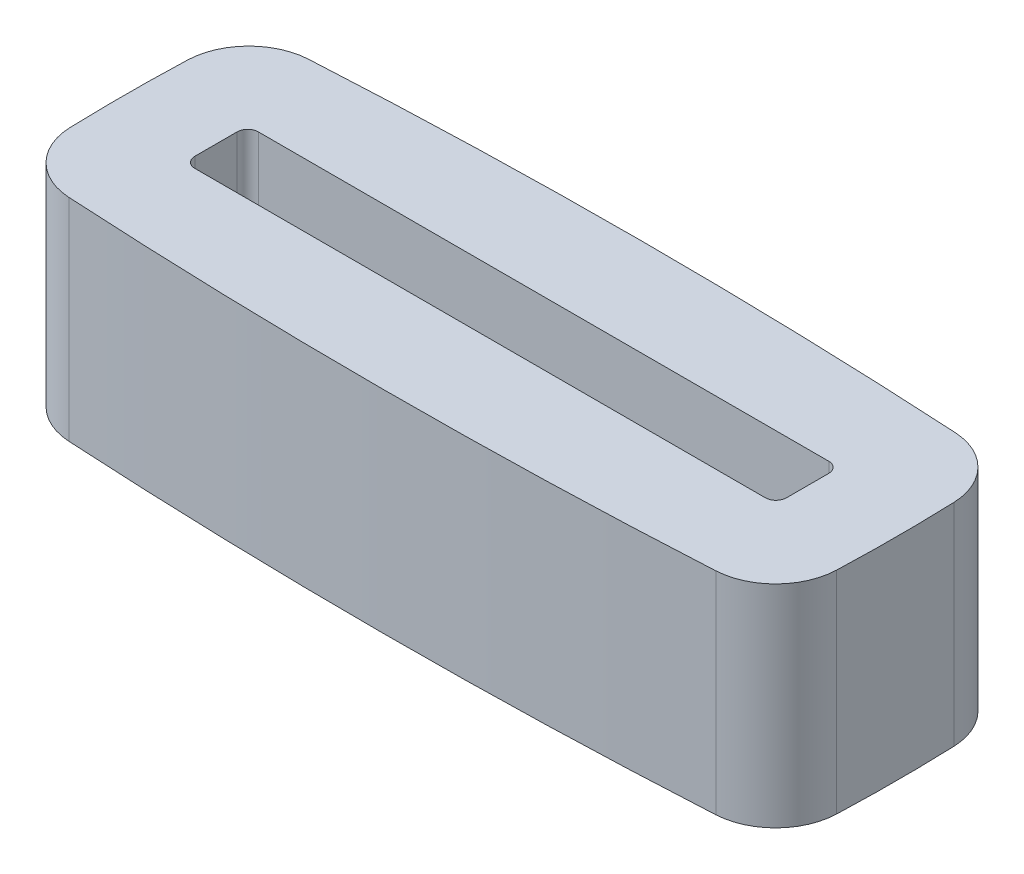
ISO-10303-21;
HEADER;
FILE_DESCRIPTION(('STEP AP214'),'2;1');
FILE_NAME('part.step','',(''),(''),'','','');
FILE_SCHEMA(('AUTOMOTIVE_DESIGN { 1 0 10303 214 1 1 1 1 }'));
ENDSEC;
DATA;
#1=APPLICATION_CONTEXT('core data for automotive mechanical design processes');
#2=APPLICATION_PROTOCOL_DEFINITION('international standard','automotive_design',2000,#1);
#3=PRODUCT_CONTEXT('',#1,'mechanical');
#4=PRODUCT('Part','Part','',(#3));
#5=PRODUCT_RELATED_PRODUCT_CATEGORY('part','',(#4));
#6=PRODUCT_DEFINITION_FORMATION('','',#4);
#7=PRODUCT_DEFINITION_CONTEXT('part definition',#1,'design');
#8=PRODUCT_DEFINITION('design','',#6,#7);
#9=PRODUCT_DEFINITION_SHAPE('','',#8);
#10=(LENGTH_UNIT() NAMED_UNIT(*) SI_UNIT(.MILLI.,.METRE.));
#11=(NAMED_UNIT(*) PLANE_ANGLE_UNIT() SI_UNIT($,.RADIAN.));
#12=(NAMED_UNIT(*) SI_UNIT($,.STERADIAN.) SOLID_ANGLE_UNIT());
#13=UNCERTAINTY_MEASURE_WITH_UNIT(LENGTH_MEASURE(1.E-05),#10,'distance_accuracy_value','');
#14=(GEOMETRIC_REPRESENTATION_CONTEXT(3) GLOBAL_UNCERTAINTY_ASSIGNED_CONTEXT((#13)) GLOBAL_UNIT_ASSIGNED_CONTEXT((#10,
#11,#12)) REPRESENTATION_CONTEXT('',''));
#15=CARTESIAN_POINT('',(0.,0.,0.));
#16=DIRECTION('',(0.,0.,1.));
#17=DIRECTION('',(1.,0.,0.));
#18=AXIS2_PLACEMENT_3D('',#15,#16,#17);
#19=CARTESIAN_POINT('',(23.7685199199291,10.,131.074830109099));
#20=DIRECTION('',(0.,-1.,0.));
#21=DIRECTION('',(0.,0.,-1.));
#22=AXIS2_PLACEMENT_3D('',#19,#20,#21);
#23=PLANE('',#22);
#24=CARTESIAN_POINT('',(55.493496787136,10.,-0.700070294959144));
#25=DIRECTION('',(0.,1.,0.));
#26=DIRECTION('',(0.,0.,-1.));
#27=AXIS2_PLACEMENT_3D('',#24,#25,#26);
#28=CIRCLE('',#27,81.635723644874);
#29=CARTESIAN_POINT('',(-26.0872461160428,10.,-3.69569416782523));
#30=VERTEX_POINT('',#29);
#31=CARTESIAN_POINT('',(-26.102389019081,10.,1.84998745360925));
#32=VERTEX_POINT('',#31);
#33=EDGE_CURVE('E185',#30,#32,#28,.T.);
#34=ORIENTED_EDGE('',*,*,#33,.T.);
#35=CARTESIAN_POINT('',(-23.1038530045843,10.,1.75627635625946));
#36=DIRECTION('',(0.,-1.,0.));
#37=DIRECTION('',(0.,0.,-1.));
#38=AXIS2_PLACEMENT_3D('',#35,#36,#37);
#39=CIRCLE('',#38,3.);
#40=CARTESIAN_POINT('',(-23.2736945501107,10.,4.75146480599231));
#41=VERTEX_POINT('',#40);
#42=EDGE_CURVE('E201',#32,#41,#39,.F.);
#43=ORIENTED_EDGE('',*,*,#42,.T.);
#44=CARTESIAN_POINT('',(-7.97097129818498,10.,-265.115014514933));
#45=DIRECTION('',(0.,1.,0.));
#46=DIRECTION('',(0.,0.,1.));
#47=AXIS2_PLACEMENT_3D('',#44,#45,#46);
#48=CIRCLE('',#47,270.299999999994);
#49=CARTESIAN_POINT('',(7.35003417254099,10.,4.75042749527038));
#50=VERTEX_POINT('',#49);
#51=EDGE_CURVE('E166',#41,#50,#48,.T.);
#52=ORIENTED_EDGE('',*,*,#51,.T.);
#53=CARTESIAN_POINT('',(7.17998971670607,10.,1.7552505584201));
#54=DIRECTION('',(0.,-1.,0.));
#55=DIRECTION('',(0.,0.,-1.));
#56=AXIS2_PLACEMENT_3D('',#53,#54,#55);
#57=CIRCLE('',#56,3.);
#58=CARTESIAN_POINT('',(10.177966795354,10.,1.86540243494233));
#59=VERTEX_POINT('',#58);
#60=EDGE_CURVE('E199',#50,#59,#57,.F.);
#61=ORIENTED_EDGE('',*,*,#60,.T.);
#62=CARTESIAN_POINT('',(-65.4959712981844,10.,-0.915014514939568));
#63=DIRECTION('',(0.,1.,0.));
#64=DIRECTION('',(0.,0.,-1.));
#65=AXIS2_PLACEMENT_3D('',#62,#63,#64);
#66=CIRCLE('',#65,75.7249999999992);
#67=CARTESIAN_POINT('',(10.1779620818235,10.,-3.69555974888307));
#68=VERTEX_POINT('',#67);
#69=EDGE_CURVE('E277',#59,#68,#66,.T.);
#70=ORIENTED_EDGE('',*,*,#69,.T.);
#71=CARTESIAN_POINT('',(7.17998518991171,10.,-3.58540279012664));
#72=DIRECTION('',(0.,-1.,0.));
#73=DIRECTION('',(0.,0.,-1.));
#74=AXIS2_PLACEMENT_3D('',#71,#72,#73);
#75=CIRCLE('',#74,3.);
#76=CARTESIAN_POINT('',(7.35014377120647,10.,-6.58057324557854));
#77=VERTEX_POINT('',#76);
#78=EDGE_CURVE('E197',#68,#77,#75,.F.);
#79=ORIENTED_EDGE('',*,*,#78,.T.);
#80=CARTESIAN_POINT('',(-7.95645694727778,10.,262.849730513156));
#81=DIRECTION('',(0.,1.,0.));
#82=DIRECTION('',(0.,0.,-1.));
#83=AXIS2_PLACEMENT_3D('',#80,#81,#82);
#84=CIRCLE('',#83,269.864745028096);
#85=CARTESIAN_POINT('',(-23.2593843282785,10.,-6.58078190637462));
#86=VERTEX_POINT('',#85);
#87=EDGE_CURVE('E186',#77,#86,#84,.T.);
#88=ORIENTED_EDGE('',*,*,#87,.T.);
#89=CARTESIAN_POINT('',(-23.0892665823009,10.,-3.58560913130749));
#90=DIRECTION('',(0.,-1.,0.));
#91=DIRECTION('',(0.,0.,-1.));
#92=AXIS2_PLACEMENT_3D('',#89,#90,#91);
#93=CIRCLE('',#92,3.);
#94=EDGE_CURVE('E195',#86,#30,#93,.F.);
#95=ORIENTED_EDGE('',*,*,#94,.T.);
#96=EDGE_LOOP('',(#34,#43,#52,#61,#70,#79,#88,#95));
#97=FACE_BOUND('',#96,.T.);
#98=DIRECTION('',(0.,0.,1.));
#99=VECTOR('',#98,1.);
#100=CARTESIAN_POINT('',(-21.9709712981852,10.,0.584985485060434));
#101=LINE('',#100,#99);
#102=CARTESIAN_POINT('',(-21.9709712981852,10.,-1.91501451493957));
#103=VERTEX_POINT('',#102);
#104=CARTESIAN_POINT('',(-21.9709712981852,10.,0.0849854850604342));
#105=VERTEX_POINT('',#104);
#106=EDGE_CURVE('E255',#103,#105,#101,.T.);
#107=ORIENTED_EDGE('',*,*,#106,.F.);
#108=CARTESIAN_POINT('',(-21.4709712981852,10.,-1.91501451493957));
#109=DIRECTION('',(0.,-1.,0.));
#110=DIRECTION('',(0.,0.,-1.));
#111=AXIS2_PLACEMENT_3D('',#108,#109,#110);
#112=CIRCLE('',#111,0.5);
#113=CARTESIAN_POINT('',(-21.4709712981852,10.,-2.41501451493957));
#114=VERTEX_POINT('',#113);
#115=EDGE_CURVE('E238',#103,#114,#112,.T.);
#116=ORIENTED_EDGE('',*,*,#115,.T.);
#117=DIRECTION('',(-1.,0.,0.));
#118=VECTOR('',#117,1.);
#119=CARTESIAN_POINT('',(6.0290287018148,10.,-2.41501451493957));
#120=LINE('',#119,#118);
#121=CARTESIAN_POINT('',(5.5290287018148,10.,-2.41501451493957));
#122=VERTEX_POINT('',#121);
#123=EDGE_CURVE('E179',#122,#114,#120,.T.);
#124=ORIENTED_EDGE('',*,*,#123,.F.);
#125=CARTESIAN_POINT('',(5.5290287018148,10.,-1.91501451493957));
#126=DIRECTION('',(0.,-1.,0.));
#127=DIRECTION('',(0.,0.,-1.));
#128=AXIS2_PLACEMENT_3D('',#125,#126,#127);
#129=CIRCLE('',#128,0.5);
#130=CARTESIAN_POINT('',(6.0290287018148,10.,-1.91501451493957));
#131=VERTEX_POINT('',#130);
#132=EDGE_CURVE('E11',#122,#131,#129,.T.);
#133=ORIENTED_EDGE('',*,*,#132,.T.);
#134=DIRECTION('',(0.,0.,-1.));
#135=VECTOR('',#134,1.);
#136=CARTESIAN_POINT('',(6.0290287018148,10.,0.584985485060431));
#137=LINE('',#136,#135);
#138=CARTESIAN_POINT('',(6.0290287018148,10.,0.0849854850604307));
#139=VERTEX_POINT('',#138);
#140=EDGE_CURVE('E258',#139,#131,#137,.T.);
#141=ORIENTED_EDGE('',*,*,#140,.F.);
#142=CARTESIAN_POINT('',(5.5290287018148,10.,0.0849854850604309));
#143=DIRECTION('',(0.,-1.,0.));
#144=DIRECTION('',(0.,0.,-1.));
#145=AXIS2_PLACEMENT_3D('',#142,#143,#144);
#146=CIRCLE('',#145,0.5);
#147=CARTESIAN_POINT('',(5.5290287018148,10.,0.584985485060431));
#148=VERTEX_POINT('',#147);
#149=EDGE_CURVE('E242',#139,#148,#146,.T.);
#150=ORIENTED_EDGE('',*,*,#149,.T.);
#151=DIRECTION('',(1.,0.,0.));
#152=VECTOR('',#151,1.);
#153=CARTESIAN_POINT('',(6.0290287018148,10.,0.584985485060431));
#154=LINE('',#153,#152);
#155=CARTESIAN_POINT('',(-21.4709712981852,10.,0.584985485060434));
#156=VERTEX_POINT('',#155);
#157=EDGE_CURVE('E260',#156,#148,#154,.T.);
#158=ORIENTED_EDGE('',*,*,#157,.F.);
#159=CARTESIAN_POINT('',(-21.4709712981852,10.,0.0849854850604342));
#160=DIRECTION('',(0.,-1.,0.));
#161=DIRECTION('',(0.,0.,-1.));
#162=AXIS2_PLACEMENT_3D('',#159,#160,#161);
#163=CIRCLE('',#162,0.5);
#164=EDGE_CURVE('E234',#156,#105,#163,.T.);
#165=ORIENTED_EDGE('',*,*,#164,.T.);
#166=EDGE_LOOP('',(#107,#116,#124,#133,#141,#150,#158,#165));
#167=FACE_BOUND('',#166,.T.);
#168=ADVANCED_FACE('F33',(#97,#167),#23,.F.);
#169=CARTESIAN_POINT('',(23.7685199199291,0.,131.074830109099));
#170=DIRECTION('',(0.,-1.,0.));
#171=DIRECTION('',(0.,0.,-1.));
#172=AXIS2_PLACEMENT_3D('',#169,#170,#171);
#173=PLANE('',#172);
#174=CARTESIAN_POINT('',(-7.97097129818498,0.,-265.115014514933));
#175=DIRECTION('',(0.,1.,0.));
#176=DIRECTION('',(0.,0.,1.));
#177=AXIS2_PLACEMENT_3D('',#174,#175,#176);
#178=CIRCLE('',#177,270.299999999994);
#179=CARTESIAN_POINT('',(-23.2736945501107,0.,4.75146480599231));
#180=VERTEX_POINT('',#179);
#181=CARTESIAN_POINT('',(7.35003417254099,0.,4.75042749527038));
#182=VERTEX_POINT('',#181);
#183=EDGE_CURVE('E163',#180,#182,#178,.T.);
#184=ORIENTED_EDGE('',*,*,#183,.F.);
#185=CARTESIAN_POINT('',(-23.1038530045843,0.,1.75627635625946));
#186=DIRECTION('',(0.,-1.,0.));
#187=DIRECTION('',(0.,0.,-1.));
#188=AXIS2_PLACEMENT_3D('',#185,#186,#187);
#189=CIRCLE('',#188,3.);
#190=CARTESIAN_POINT('',(-26.102389019081,0.,1.84998745360925));
#191=VERTEX_POINT('',#190);
#192=EDGE_CURVE('E146',#180,#191,#189,.T.);
#193=ORIENTED_EDGE('',*,*,#192,.T.);
#194=CARTESIAN_POINT('',(55.493496787136,0.,-0.700070294959144));
#195=DIRECTION('',(0.,1.,0.));
#196=DIRECTION('',(0.,0.,-1.));
#197=AXIS2_PLACEMENT_3D('',#194,#195,#196);
#198=CIRCLE('',#197,81.635723644874);
#199=CARTESIAN_POINT('',(-26.0872461160428,0.,-3.69569416782523));
#200=VERTEX_POINT('',#199);
#201=EDGE_CURVE('E174',#200,#191,#198,.T.);
#202=ORIENTED_EDGE('',*,*,#201,.F.);
#203=CARTESIAN_POINT('',(-23.0892665823009,0.,-3.58560913130749));
#204=DIRECTION('',(0.,-1.,0.));
#205=DIRECTION('',(0.,0.,-1.));
#206=AXIS2_PLACEMENT_3D('',#203,#204,#205);
#207=CIRCLE('',#206,3.);
#208=CARTESIAN_POINT('',(-23.2593843282785,0.,-6.58078190637462));
#209=VERTEX_POINT('',#208);
#210=EDGE_CURVE('E167',#200,#209,#207,.T.);
#211=ORIENTED_EDGE('',*,*,#210,.T.);
#212=CARTESIAN_POINT('',(-7.95645694727778,0.,262.849730513156));
#213=DIRECTION('',(0.,1.,0.));
#214=DIRECTION('',(0.,0.,-1.));
#215=AXIS2_PLACEMENT_3D('',#212,#213,#214);
#216=CIRCLE('',#215,269.864745028096);
#217=CARTESIAN_POINT('',(7.35014377120647,0.,-6.58057324557854));
#218=VERTEX_POINT('',#217);
#219=EDGE_CURVE('E177',#218,#209,#216,.T.);
#220=ORIENTED_EDGE('',*,*,#219,.F.);
#221=CARTESIAN_POINT('',(7.17998518991171,0.,-3.58540279012664));
#222=DIRECTION('',(0.,-1.,0.));
#223=DIRECTION('',(0.,0.,-1.));
#224=AXIS2_PLACEMENT_3D('',#221,#222,#223);
#225=CIRCLE('',#224,3.);
#226=CARTESIAN_POINT('',(10.1779620818235,0.,-3.69555974888307));
#227=VERTEX_POINT('',#226);
#228=EDGE_CURVE('E189',#218,#227,#225,.T.);
#229=ORIENTED_EDGE('',*,*,#228,.T.);
#230=CARTESIAN_POINT('',(-65.4959712981844,0.,-0.915014514939568));
#231=DIRECTION('',(0.,1.,0.));
#232=DIRECTION('',(0.,0.,-1.));
#233=AXIS2_PLACEMENT_3D('',#230,#231,#232);
#234=CIRCLE('',#233,75.7249999999992);
#235=CARTESIAN_POINT('',(10.177966795354,0.,1.86540243494233));
#236=VERTEX_POINT('',#235);
#237=EDGE_CURVE('E173',#236,#227,#234,.T.);
#238=ORIENTED_EDGE('',*,*,#237,.F.);
#239=CARTESIAN_POINT('',(7.17998971670607,0.,1.7552505584201));
#240=DIRECTION('',(0.,-1.,0.));
#241=DIRECTION('',(0.,0.,-1.));
#242=AXIS2_PLACEMENT_3D('',#239,#240,#241);
#243=CIRCLE('',#242,3.);
#244=EDGE_CURVE('E157',#236,#182,#243,.T.);
#245=ORIENTED_EDGE('',*,*,#244,.T.);
#246=EDGE_LOOP('',(#184,#193,#202,#211,#220,#229,#238,#245));
#247=FACE_BOUND('',#246,.T.);
#248=DIRECTION('',(0.,0.,-1.));
#249=VECTOR('',#248,1.);
#250=CARTESIAN_POINT('',(6.0290287018148,0.,0.584985485060431));
#251=LINE('',#250,#249);
#252=CARTESIAN_POINT('',(6.0290287018148,0.,0.0849854850604307));
#253=VERTEX_POINT('',#252);
#254=CARTESIAN_POINT('',(6.0290287018148,0.,-1.91501451493957));
#255=VERTEX_POINT('',#254);
#256=EDGE_CURVE('E247',#253,#255,#251,.T.);
#257=ORIENTED_EDGE('',*,*,#256,.T.);
#258=CARTESIAN_POINT('',(5.5290287018148,0.,-1.91501451493957));
#259=DIRECTION('',(0.,-1.,0.));
#260=DIRECTION('',(0.,0.,-1.));
#261=AXIS2_PLACEMENT_3D('',#258,#259,#260);
#262=CIRCLE('',#261,0.5);
#263=CARTESIAN_POINT('',(5.5290287018148,0.,-2.41501451493957));
#264=VERTEX_POINT('',#263);
#265=EDGE_CURVE('E41',#255,#264,#262,.F.);
#266=ORIENTED_EDGE('',*,*,#265,.T.);
#267=DIRECTION('',(-1.,0.,0.));
#268=VECTOR('',#267,1.);
#269=CARTESIAN_POINT('',(6.0290287018148,0.,-2.41501451493957));
#270=LINE('',#269,#268);
#271=CARTESIAN_POINT('',(-21.4709712981852,0.,-2.41501451493957));
#272=VERTEX_POINT('',#271);
#273=EDGE_CURVE('E246',#264,#272,#270,.T.);
#274=ORIENTED_EDGE('',*,*,#273,.T.);
#275=CARTESIAN_POINT('',(-21.4709712981852,0.,-1.91501451493957));
#276=DIRECTION('',(0.,-1.,0.));
#277=DIRECTION('',(0.,0.,-1.));
#278=AXIS2_PLACEMENT_3D('',#275,#276,#277);
#279=CIRCLE('',#278,0.5);
#280=CARTESIAN_POINT('',(-21.9709712981852,0.,-1.91501451493957));
#281=VERTEX_POINT('',#280);
#282=EDGE_CURVE('E236',#272,#281,#279,.F.);
#283=ORIENTED_EDGE('',*,*,#282,.T.);
#284=DIRECTION('',(0.,0.,1.));
#285=VECTOR('',#284,1.);
#286=CARTESIAN_POINT('',(-21.9709712981852,0.,0.584985485060434));
#287=LINE('',#286,#285);
#288=CARTESIAN_POINT('',(-21.9709712981852,0.,0.0849854850604342));
#289=VERTEX_POINT('',#288);
#290=EDGE_CURVE('E267',#281,#289,#287,.T.);
#291=ORIENTED_EDGE('',*,*,#290,.T.);
#292=CARTESIAN_POINT('',(-21.4709712981852,0.,0.0849854850604342));
#293=DIRECTION('',(0.,-1.,0.));
#294=DIRECTION('',(0.,0.,-1.));
#295=AXIS2_PLACEMENT_3D('',#292,#293,#294);
#296=CIRCLE('',#295,0.5);
#297=CARTESIAN_POINT('',(-21.4709712981852,0.,0.584985485060434));
#298=VERTEX_POINT('',#297);
#299=EDGE_CURVE('E232',#289,#298,#296,.F.);
#300=ORIENTED_EDGE('',*,*,#299,.T.);
#301=DIRECTION('',(1.,0.,0.));
#302=VECTOR('',#301,1.);
#303=CARTESIAN_POINT('',(6.0290287018148,0.,0.584985485060431));
#304=LINE('',#303,#302);
#305=CARTESIAN_POINT('',(5.5290287018148,0.,0.584985485060431));
#306=VERTEX_POINT('',#305);
#307=EDGE_CURVE('E270',#298,#306,#304,.T.);
#308=ORIENTED_EDGE('',*,*,#307,.T.);
#309=CARTESIAN_POINT('',(5.5290287018148,0.,0.0849854850604309));
#310=DIRECTION('',(0.,-1.,0.));
#311=DIRECTION('',(0.,0.,-1.));
#312=AXIS2_PLACEMENT_3D('',#309,#310,#311);
#313=CIRCLE('',#312,0.5);
#314=EDGE_CURVE('E240',#306,#253,#313,.F.);
#315=ORIENTED_EDGE('',*,*,#314,.T.);
#316=EDGE_LOOP('',(#257,#266,#274,#283,#291,#300,#308,#315));
#317=FACE_BOUND('',#316,.T.);
#318=ADVANCED_FACE('F170',(#247,#317),#173,.T.);
#319=CARTESIAN_POINT('',(55.493496787136,10.,-0.700070294959144));
#320=DIRECTION('',(0.,-1.,0.));
#321=DIRECTION('',(0.,0.,-1.));
#322=AXIS2_PLACEMENT_3D('',#319,#320,#321);
#323=CYLINDRICAL_SURFACE('',#322,81.635723644874);
#324=ORIENTED_EDGE('',*,*,#201,.T.);
#325=DIRECTION('',(0.,-1.,0.));
#326=VECTOR('',#325,1.);
#327=CARTESIAN_POINT('',(-26.102389019081,10.,1.84998745360925));
#328=LINE('',#327,#326);
#329=EDGE_CURVE('E151',#191,#32,#328,.F.);
#330=ORIENTED_EDGE('',*,*,#329,.T.);
#331=ORIENTED_EDGE('',*,*,#33,.F.);
#332=DIRECTION('',(0.,-1.,0.));
#333=VECTOR('',#332,1.);
#334=CARTESIAN_POINT('',(-26.0872461160428,10.,-3.69569416782523));
#335=LINE('',#334,#333);
#336=EDGE_CURVE('E156',#30,#200,#335,.T.);
#337=ORIENTED_EDGE('',*,*,#336,.T.);
#338=EDGE_LOOP('',(#324,#330,#331,#337));
#339=FACE_BOUND('',#338,.T.);
#340=ADVANCED_FACE('F292',(#339),#323,.T.);
#341=CARTESIAN_POINT('',(-7.97097129818498,10.,-265.115014514933));
#342=DIRECTION('',(0.,-1.,0.));
#343=DIRECTION('',(0.,0.,-1.));
#344=AXIS2_PLACEMENT_3D('',#341,#342,#343);
#345=CYLINDRICAL_SURFACE('',#344,270.299999999994);
#346=ORIENTED_EDGE('',*,*,#51,.F.);
#347=DIRECTION('',(0.,-1.,0.));
#348=VECTOR('',#347,1.);
#349=CARTESIAN_POINT('',(-23.2736945501107,10.,4.75146480599231));
#350=LINE('',#349,#348);
#351=EDGE_CURVE('E150',#41,#180,#350,.T.);
#352=ORIENTED_EDGE('',*,*,#351,.T.);
#353=ORIENTED_EDGE('',*,*,#183,.T.);
#354=DIRECTION('',(0.,-1.,0.));
#355=VECTOR('',#354,1.);
#356=CARTESIAN_POINT('',(7.35003417254099,10.,4.75042749527038));
#357=LINE('',#356,#355);
#358=EDGE_CURVE('E168',#182,#50,#357,.F.);
#359=ORIENTED_EDGE('',*,*,#358,.T.);
#360=EDGE_LOOP('',(#346,#352,#353,#359));
#361=FACE_BOUND('',#360,.T.);
#362=ADVANCED_FACE('F162',(#361),#345,.T.);
#363=CARTESIAN_POINT('',(-65.4959712981844,10.,-0.915014514939568));
#364=DIRECTION('',(0.,-1.,0.));
#365=DIRECTION('',(0.,0.,-1.));
#366=AXIS2_PLACEMENT_3D('',#363,#364,#365);
#367=CYLINDRICAL_SURFACE('',#366,75.7249999999992);
#368=ORIENTED_EDGE('',*,*,#69,.F.);
#369=DIRECTION('',(0.,-1.,0.));
#370=VECTOR('',#369,1.);
#371=CARTESIAN_POINT('',(10.177966795354,10.,1.86540243494233));
#372=LINE('',#371,#370);
#373=EDGE_CURVE('E205',#59,#236,#372,.T.);
#374=ORIENTED_EDGE('',*,*,#373,.T.);
#375=ORIENTED_EDGE('',*,*,#237,.T.);
#376=DIRECTION('',(0.,-1.,0.));
#377=VECTOR('',#376,1.);
#378=CARTESIAN_POINT('',(10.1779620818235,10.,-3.69555974888307));
#379=LINE('',#378,#377);
#380=EDGE_CURVE('E203',#227,#68,#379,.F.);
#381=ORIENTED_EDGE('',*,*,#380,.T.);
#382=EDGE_LOOP('',(#368,#374,#375,#381));
#383=FACE_BOUND('',#382,.T.);
#384=ADVANCED_FACE('F300',(#383),#367,.T.);
#385=CARTESIAN_POINT('',(-7.95645694727778,10.,262.849730513156));
#386=DIRECTION('',(0.,-1.,0.));
#387=DIRECTION('',(0.,0.,-1.));
#388=AXIS2_PLACEMENT_3D('',#385,#386,#387);
#389=CYLINDRICAL_SURFACE('',#388,269.864745028096);
#390=ORIENTED_EDGE('',*,*,#87,.F.);
#391=DIRECTION('',(0.,-1.,0.));
#392=VECTOR('',#391,1.);
#393=CARTESIAN_POINT('',(7.35014377120647,10.,-6.58057324557854));
#394=LINE('',#393,#392);
#395=EDGE_CURVE('E210',#77,#218,#394,.T.);
#396=ORIENTED_EDGE('',*,*,#395,.T.);
#397=ORIENTED_EDGE('',*,*,#219,.T.);
#398=DIRECTION('',(0.,-1.,0.));
#399=VECTOR('',#398,1.);
#400=CARTESIAN_POINT('',(-23.2593843282785,10.,-6.58078190637468));
#401=LINE('',#400,#399);
#402=EDGE_CURVE('E208',#209,#86,#401,.F.);
#403=ORIENTED_EDGE('',*,*,#402,.T.);
#404=EDGE_LOOP('',(#390,#396,#397,#403));
#405=FACE_BOUND('',#404,.T.);
#406=ADVANCED_FACE('F294',(#405),#389,.T.);
#407=CARTESIAN_POINT('',(-21.9709712981852,10.,0.584985485060434));
#408=DIRECTION('',(1.,0.,0.));
#409=DIRECTION('',(0.,0.,-1.));
#410=AXIS2_PLACEMENT_3D('',#407,#408,#409);
#411=PLANE('',#410);
#412=ORIENTED_EDGE('',*,*,#106,.T.);
#413=DIRECTION('',(0.,-1.,0.));
#414=VECTOR('',#413,1.);
#415=CARTESIAN_POINT('',(-21.9709712981852,0.,0.0849854850604342));
#416=LINE('',#415,#414);
#417=EDGE_CURVE('E215',#105,#289,#416,.T.);
#418=ORIENTED_EDGE('',*,*,#417,.T.);
#419=ORIENTED_EDGE('',*,*,#290,.F.);
#420=DIRECTION('',(0.,-1.,0.));
#421=VECTOR('',#420,1.);
#422=CARTESIAN_POINT('',(-21.9709712981852,10.,-1.91501451493957));
#423=LINE('',#422,#421);
#424=EDGE_CURVE('E213',#281,#103,#423,.F.);
#425=ORIENTED_EDGE('',*,*,#424,.T.);
#426=EDGE_LOOP('',(#412,#418,#419,#425));
#427=FACE_BOUND('',#426,.T.);
#428=ADVANCED_FACE('F320',(#427),#411,.T.);
#429=CARTESIAN_POINT('',(6.0290287018148,10.,0.584985485060431));
#430=DIRECTION('',(0.,0.,-1.));
#431=DIRECTION('',(-1.,0.,0.));
#432=AXIS2_PLACEMENT_3D('',#429,#430,#431);
#433=PLANE('',#432);
#434=ORIENTED_EDGE('',*,*,#307,.F.);
#435=DIRECTION('',(0.,-1.,0.));
#436=VECTOR('',#435,1.);
#437=CARTESIAN_POINT('',(-21.4709712981852,10.,0.584985485060434));
#438=LINE('',#437,#436);
#439=EDGE_CURVE('E221',#298,#156,#438,.F.);
#440=ORIENTED_EDGE('',*,*,#439,.T.);
#441=ORIENTED_EDGE('',*,*,#157,.T.);
#442=DIRECTION('',(0.,-1.,0.));
#443=VECTOR('',#442,1.);
#444=CARTESIAN_POINT('',(5.5290287018148,0.,0.584985485060431));
#445=LINE('',#444,#443);
#446=EDGE_CURVE('E218',#148,#306,#445,.T.);
#447=ORIENTED_EDGE('',*,*,#446,.T.);
#448=EDGE_LOOP('',(#434,#440,#441,#447));
#449=FACE_BOUND('',#448,.T.);
#450=ADVANCED_FACE('F353',(#449),#433,.T.);
#451=CARTESIAN_POINT('',(6.0290287018148,10.,0.584985485060431));
#452=DIRECTION('',(-1.,0.,0.));
#453=DIRECTION('',(0.,0.,1.));
#454=AXIS2_PLACEMENT_3D('',#451,#452,#453);
#455=PLANE('',#454);
#456=ORIENTED_EDGE('',*,*,#256,.F.);
#457=DIRECTION('',(0.,-1.,0.));
#458=VECTOR('',#457,1.);
#459=CARTESIAN_POINT('',(6.0290287018148,10.,0.0849854850604307));
#460=LINE('',#459,#458);
#461=EDGE_CURVE('E53',#253,#139,#460,.F.);
#462=ORIENTED_EDGE('',*,*,#461,.T.);
#463=ORIENTED_EDGE('',*,*,#140,.T.);
#464=DIRECTION('',(0.,-1.,0.));
#465=VECTOR('',#464,1.);
#466=CARTESIAN_POINT('',(6.0290287018148,0.,-1.91501451493957));
#467=LINE('',#466,#465);
#468=EDGE_CURVE('E228',#131,#255,#467,.T.);
#469=ORIENTED_EDGE('',*,*,#468,.T.);
#470=EDGE_LOOP('',(#456,#462,#463,#469));
#471=FACE_BOUND('',#470,.T.);
#472=ADVANCED_FACE('F257',(#471),#455,.T.);
#473=CARTESIAN_POINT('',(6.0290287018148,10.,-2.41501451493957));
#474=DIRECTION('',(0.,0.,1.));
#475=DIRECTION('',(1.,0.,0.));
#476=AXIS2_PLACEMENT_3D('',#473,#474,#475);
#477=PLANE('',#476);
#478=ORIENTED_EDGE('',*,*,#123,.T.);
#479=DIRECTION('',(0.,-1.,0.));
#480=VECTOR('',#479,1.);
#481=CARTESIAN_POINT('',(-21.4709712981852,0.,-2.41501451493957));
#482=LINE('',#481,#480);
#483=EDGE_CURVE('E225',#114,#272,#482,.T.);
#484=ORIENTED_EDGE('',*,*,#483,.T.);
#485=ORIENTED_EDGE('',*,*,#273,.F.);
#486=DIRECTION('',(0.,-1.,0.));
#487=VECTOR('',#486,1.);
#488=CARTESIAN_POINT('',(5.5290287018148,10.,-2.41501451493957));
#489=LINE('',#488,#487);
#490=EDGE_CURVE('E223',#264,#122,#489,.F.);
#491=ORIENTED_EDGE('',*,*,#490,.T.);
#492=EDGE_LOOP('',(#478,#484,#485,#491));
#493=FACE_BOUND('',#492,.T.);
#494=ADVANCED_FACE('F253',(#493),#477,.T.);
#495=CARTESIAN_POINT('',(-23.1038530045843,10.,1.75627635625946));
#496=DIRECTION('',(0.,-1.,0.));
#497=DIRECTION('',(0.,0.,-1.));
#498=AXIS2_PLACEMENT_3D('',#495,#496,#497);
#499=CYLINDRICAL_SURFACE('',#498,3.);
#500=ORIENTED_EDGE('',*,*,#42,.F.);
#501=ORIENTED_EDGE('',*,*,#329,.F.);
#502=ORIENTED_EDGE('',*,*,#192,.F.);
#503=ORIENTED_EDGE('',*,*,#351,.F.);
#504=EDGE_LOOP('',(#500,#501,#502,#503));
#505=FACE_BOUND('',#504,.T.);
#506=ADVANCED_FACE('F149',(#505),#499,.T.);
#507=CARTESIAN_POINT('',(7.17998971670607,10.,1.7552505584201));
#508=DIRECTION('',(0.,-1.,0.));
#509=DIRECTION('',(0.,0.,-1.));
#510=AXIS2_PLACEMENT_3D('',#507,#508,#509);
#511=CYLINDRICAL_SURFACE('',#510,3.);
#512=ORIENTED_EDGE('',*,*,#60,.F.);
#513=ORIENTED_EDGE('',*,*,#358,.F.);
#514=ORIENTED_EDGE('',*,*,#244,.F.);
#515=ORIENTED_EDGE('',*,*,#373,.F.);
#516=EDGE_LOOP('',(#512,#513,#514,#515));
#517=FACE_BOUND('',#516,.T.);
#518=ADVANCED_FACE('F304',(#517),#511,.T.);
#519=CARTESIAN_POINT('',(7.17998518991171,10.,-3.58540279012664));
#520=DIRECTION('',(0.,-1.,0.));
#521=DIRECTION('',(0.,0.,-1.));
#522=AXIS2_PLACEMENT_3D('',#519,#520,#521);
#523=CYLINDRICAL_SURFACE('',#522,3.);
#524=ORIENTED_EDGE('',*,*,#78,.F.);
#525=ORIENTED_EDGE('',*,*,#380,.F.);
#526=ORIENTED_EDGE('',*,*,#228,.F.);
#527=ORIENTED_EDGE('',*,*,#395,.F.);
#528=EDGE_LOOP('',(#524,#525,#526,#527));
#529=FACE_BOUND('',#528,.T.);
#530=ADVANCED_FACE('F296',(#529),#523,.T.);
#531=CARTESIAN_POINT('',(-23.0892665823009,10.,-3.58560913130749));
#532=DIRECTION('',(0.,-1.,0.));
#533=DIRECTION('',(0.,0.,-1.));
#534=AXIS2_PLACEMENT_3D('',#531,#532,#533);
#535=CYLINDRICAL_SURFACE('',#534,3.);
#536=ORIENTED_EDGE('',*,*,#94,.F.);
#537=ORIENTED_EDGE('',*,*,#402,.F.);
#538=ORIENTED_EDGE('',*,*,#210,.F.);
#539=ORIENTED_EDGE('',*,*,#336,.F.);
#540=EDGE_LOOP('',(#536,#537,#538,#539));
#541=FACE_BOUND('',#540,.T.);
#542=ADVANCED_FACE('F290',(#541),#535,.T.);
#543=CARTESIAN_POINT('',(-21.4709712981852,10.,0.0849854850604342));
#544=DIRECTION('',(0.,1.,0.));
#545=DIRECTION('',(0.,0.,1.));
#546=AXIS2_PLACEMENT_3D('',#543,#544,#545);
#547=CYLINDRICAL_SURFACE('',#546,0.5);
#548=ORIENTED_EDGE('',*,*,#164,.F.);
#549=ORIENTED_EDGE('',*,*,#439,.F.);
#550=ORIENTED_EDGE('',*,*,#299,.F.);
#551=ORIENTED_EDGE('',*,*,#417,.F.);
#552=EDGE_LOOP('',(#548,#549,#550,#551));
#553=FACE_BOUND('',#552,.T.);
#554=ADVANCED_FACE('F394',(#553),#547,.F.);
#555=CARTESIAN_POINT('',(-21.4709712981852,10.,-1.91501451493957));
#556=DIRECTION('',(0.,1.,0.));
#557=DIRECTION('',(0.,0.,1.));
#558=AXIS2_PLACEMENT_3D('',#555,#556,#557);
#559=CYLINDRICAL_SURFACE('',#558,0.5);
#560=ORIENTED_EDGE('',*,*,#115,.F.);
#561=ORIENTED_EDGE('',*,*,#424,.F.);
#562=ORIENTED_EDGE('',*,*,#282,.F.);
#563=ORIENTED_EDGE('',*,*,#483,.F.);
#564=EDGE_LOOP('',(#560,#561,#562,#563));
#565=FACE_BOUND('',#564,.T.);
#566=ADVANCED_FACE('F427',(#565),#559,.F.);
#567=CARTESIAN_POINT('',(5.5290287018148,10.,0.0849854850604309));
#568=DIRECTION('',(0.,1.,0.));
#569=DIRECTION('',(0.,0.,1.));
#570=AXIS2_PLACEMENT_3D('',#567,#568,#569);
#571=CYLINDRICAL_SURFACE('',#570,0.5);
#572=ORIENTED_EDGE('',*,*,#149,.F.);
#573=ORIENTED_EDGE('',*,*,#461,.F.);
#574=ORIENTED_EDGE('',*,*,#314,.F.);
#575=ORIENTED_EDGE('',*,*,#446,.F.);
#576=EDGE_LOOP('',(#572,#573,#574,#575));
#577=FACE_BOUND('',#576,.T.);
#578=ADVANCED_FACE('F434',(#577),#571,.F.);
#579=CARTESIAN_POINT('',(5.5290287018148,10.,-1.91501451493957));
#580=DIRECTION('',(0.,1.,0.));
#581=DIRECTION('',(0.,0.,1.));
#582=AXIS2_PLACEMENT_3D('',#579,#580,#581);
#583=CYLINDRICAL_SURFACE('',#582,0.5);
#584=ORIENTED_EDGE('',*,*,#132,.F.);
#585=ORIENTED_EDGE('',*,*,#490,.F.);
#586=ORIENTED_EDGE('',*,*,#265,.F.);
#587=ORIENTED_EDGE('',*,*,#468,.F.);
#588=EDGE_LOOP('',(#584,#585,#586,#587));
#589=FACE_BOUND('',#588,.T.);
#590=ADVANCED_FACE('F35',(#589),#583,.F.);
#591=CLOSED_SHELL('',(#168,#318,#340,#362,#384,#406,#428,#450,#472,#494,#506,#518,#530,#542,
#554,#566,#578,#590));
#592=MANIFOLD_SOLID_BREP('B2',#591);
#593=ADVANCED_BREP_SHAPE_REPRESENTATION('',(#18,#592),#14);
#594=SHAPE_DEFINITION_REPRESENTATION(#9,#593);
ENDSEC;
END-ISO-10303-21;
